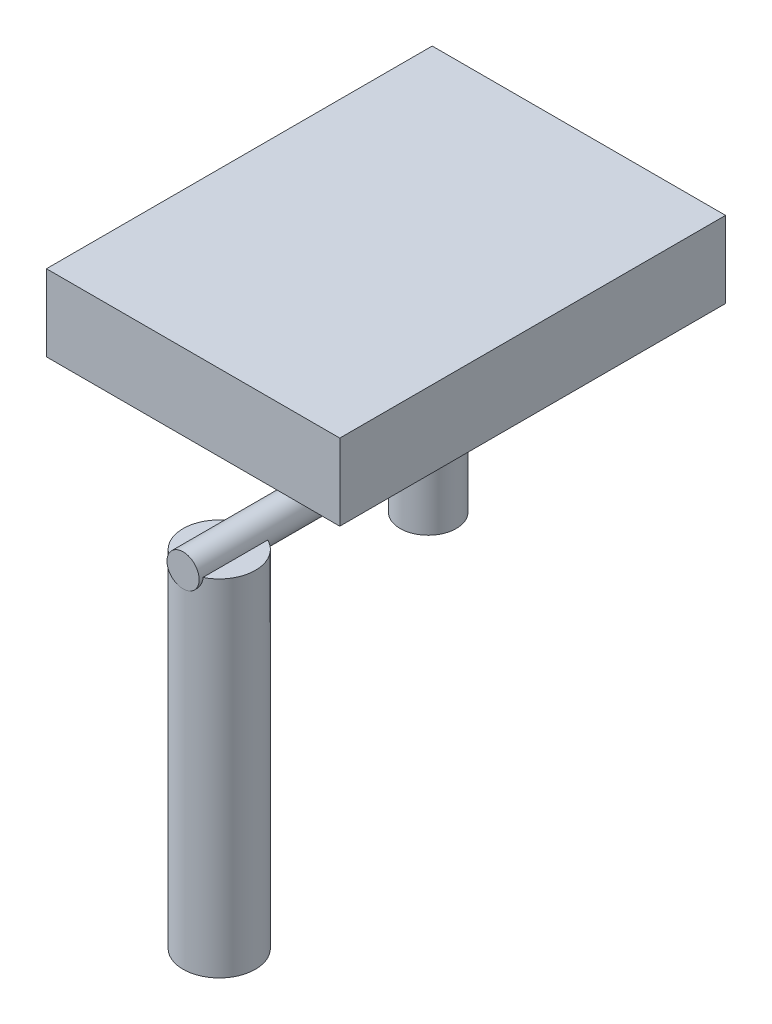
ISO-10303-21;
HEADER;
FILE_DESCRIPTION(('STEP AP214'),'2;1');
FILE_NAME('part.step','',(''),(''),'','','');
FILE_SCHEMA(('AUTOMOTIVE_DESIGN { 1 0 10303 214 1 1 1 1 }'));
ENDSEC;
DATA;
#1=APPLICATION_CONTEXT('core data for automotive mechanical design processes');
#2=APPLICATION_PROTOCOL_DEFINITION('international standard','automotive_design',2000,#1);
#3=PRODUCT_CONTEXT('',#1,'mechanical');
#4=PRODUCT('Part','Part','',(#3));
#5=PRODUCT_RELATED_PRODUCT_CATEGORY('part','',(#4));
#6=PRODUCT_DEFINITION_FORMATION('','',#4);
#7=PRODUCT_DEFINITION_CONTEXT('part definition',#1,'design');
#8=PRODUCT_DEFINITION('design','',#6,#7);
#9=PRODUCT_DEFINITION_SHAPE('','',#8);
#10=(LENGTH_UNIT() NAMED_UNIT(*) SI_UNIT(.MILLI.,.METRE.));
#11=(NAMED_UNIT(*) PLANE_ANGLE_UNIT() SI_UNIT($,.RADIAN.));
#12=(NAMED_UNIT(*) SI_UNIT($,.STERADIAN.) SOLID_ANGLE_UNIT());
#13=UNCERTAINTY_MEASURE_WITH_UNIT(LENGTH_MEASURE(1.E-05),#10,'distance_accuracy_value','');
#14=(GEOMETRIC_REPRESENTATION_CONTEXT(3) GLOBAL_UNCERTAINTY_ASSIGNED_CONTEXT((#13)) GLOBAL_UNIT_ASSIGNED_CONTEXT((#10,
#11,#12)) REPRESENTATION_CONTEXT('',''));
#15=CARTESIAN_POINT('',(0.,0.,0.));
#16=DIRECTION('',(0.,0.,1.));
#17=DIRECTION('',(1.,0.,0.));
#18=AXIS2_PLACEMENT_3D('',#15,#16,#17);
#19=CARTESIAN_POINT('',(90.8482356555996,-633.107228483542,435.));
#20=DIRECTION('',(0.,1.,0.));
#21=DIRECTION('',(0.,0.,1.));
#22=AXIS2_PLACEMENT_3D('',#19,#20,#21);
#23=CYLINDRICAL_SURFACE('',#22,45.);
#24=CARTESIAN_POINT('',(90.8482356555996,-633.107228483542,435.));
#25=DIRECTION('',(0.,-1.,0.));
#26=DIRECTION('',(0.,0.,-1.));
#27=AXIS2_PLACEMENT_3D('',#24,#25,#26);
#28=CIRCLE('',#27,45.);
#29=CARTESIAN_POINT('',(90.8482356555996,-633.107228483542,390.));
#30=VERTEX_POINT('',#29);
#31=EDGE_CURVE('E11',#30,#30,#28,.T.);
#32=ORIENTED_EDGE('',*,*,#31,.F.);
#33=EDGE_LOOP('',(#32));
#34=FACE_BOUND('',#33,.T.);
#35=CARTESIAN_POINT('',(90.8482356555996,-203.107228483542,435.));
#36=DIRECTION('',(0.,-1.,0.));
#37=DIRECTION('',(0.,0.,-1.));
#38=AXIS2_PLACEMENT_3D('',#35,#36,#37);
#39=CIRCLE('',#38,45.);
#40=CARTESIAN_POINT('',(90.8482356555996,-203.107228483542,390.));
#41=VERTEX_POINT('',#40);
#42=EDGE_CURVE('E46',#41,#41,#39,.T.);
#43=ORIENTED_EDGE('',*,*,#42,.T.);
#44=EDGE_LOOP('',(#43));
#45=FACE_BOUND('',#44,.T.);
#46=ADVANCED_FACE('F43',(#34,#45),#23,.T.);
#47=CARTESIAN_POINT('',(90.8482356555996,-633.107228483542,435.));
#48=DIRECTION('',(0.,-1.,0.));
#49=DIRECTION('',(0.,0.,-1.));
#50=AXIS2_PLACEMENT_3D('',#47,#48,#49);
#51=PLANE('',#50);
#52=ORIENTED_EDGE('',*,*,#31,.T.);
#53=EDGE_LOOP('',(#52));
#54=FACE_BOUND('',#53,.T.);
#55=ADVANCED_FACE('F58',(#54),#51,.T.);
#56=CARTESIAN_POINT('',(90.8482356555996,-203.107228483542,435.));
#57=DIRECTION('',(0.,-1.,0.));
#58=DIRECTION('',(0.,0.,-1.));
#59=AXIS2_PLACEMENT_3D('',#56,#57,#58);
#60=PLANE('',#59);
#61=ORIENTED_EDGE('',*,*,#42,.F.);
#62=EDGE_LOOP('',(#61));
#63=FACE_BOUND('',#62,.T.);
#64=ADVANCED_FACE('F56',(#63),#60,.F.);
#65=CLOSED_SHELL('',(#46,#55,#64));
#66=MANIFOLD_SOLID_BREP('B2',#65);
#67=CARTESIAN_POINT('',(-79.1517643444004,-113.107228483542,140.));
#68=DIRECTION('',(0.,0.,1.));
#69=DIRECTION('',(1.,0.,0.));
#70=AXIS2_PLACEMENT_3D('',#67,#68,#69);
#71=PLANE('',#70);
#72=DIRECTION('',(0.,1.,0.));
#73=VECTOR('',#72,1.);
#74=CARTESIAN_POINT('',(42.1142639315548,-108.107228483542,140.));
#75=LINE('',#74,#73);
#76=CARTESIAN_POINT('',(42.1142639315548,-108.107228483542,140.));
#77=VERTEX_POINT('',#76);
#78=CARTESIAN_POINT('',(42.1142639315548,-58.1072284835422,140.));
#79=VERTEX_POINT('',#78);
#80=EDGE_CURVE('E101',#77,#79,#75,.T.);
#81=ORIENTED_EDGE('',*,*,#80,.F.);
#82=DIRECTION('',(1.,0.,0.));
#83=VECTOR('',#82,1.);
#84=CARTESIAN_POINT('',(-79.1517643444004,-108.107228483542,140.));
#85=LINE('',#84,#83);
#86=CARTESIAN_POINT('',(125.8482356556,-108.107228483542,140.));
#87=VERTEX_POINT('',#86);
#88=EDGE_CURVE('E105',#77,#87,#85,.T.);
#89=ORIENTED_EDGE('',*,*,#88,.T.);
#90=DIRECTION('',(0.,1.,0.));
#91=VECTOR('',#90,1.);
#92=CARTESIAN_POINT('',(125.8482356556,-113.107228483542,140.));
#93=LINE('',#92,#91);
#94=CARTESIAN_POINT('',(125.8482356556,-113.107228483542,140.));
#95=VERTEX_POINT('',#94);
#96=EDGE_CURVE('E302',#95,#87,#93,.T.);
#97=ORIENTED_EDGE('',*,*,#96,.F.);
#98=DIRECTION('',(1.,0.,0.));
#99=VECTOR('',#98,1.);
#100=CARTESIAN_POINT('',(-79.1517643444004,-113.107228483542,140.));
#101=LINE('',#100,#99);
#102=CARTESIAN_POINT('',(90.8482356555996,-113.107228483542,140.));
#103=VERTEX_POINT('',#102);
#104=EDGE_CURVE('E320',#103,#95,#101,.T.);
#105=ORIENTED_EDGE('',*,*,#104,.F.);
#106=CARTESIAN_POINT('',(-79.1517643444004,-113.107228483542,140.));
#107=VERTEX_POINT('',#106);
#108=EDGE_CURVE('E321',#107,#103,#101,.T.);
#109=ORIENTED_EDGE('',*,*,#108,.F.);
#110=DIRECTION('',(0.,1.,0.));
#111=VECTOR('',#110,1.);
#112=CARTESIAN_POINT('',(-79.1517643444004,-113.107228483542,140.));
#113=LINE('',#112,#111);
#114=CARTESIAN_POINT('',(-79.1517643444004,-58.1072284835422,140.));
#115=VERTEX_POINT('',#114);
#116=EDGE_CURVE('E310',#107,#115,#113,.T.);
#117=ORIENTED_EDGE('',*,*,#116,.T.);
#118=DIRECTION('',(1.,0.,0.));
#119=VECTOR('',#118,1.);
#120=CARTESIAN_POINT('',(-79.1517643444004,-58.1072284835422,140.));
#121=LINE('',#120,#119);
#122=EDGE_CURVE('E180',#115,#79,#121,.T.);
#123=ORIENTED_EDGE('',*,*,#122,.T.);
#124=EDGE_LOOP('',(#81,#89,#97,#105,#109,#117,#123));
#125=FACE_BOUND('',#124,.T.);
#126=ADVANCED_FACE('F86',(#125),#71,.F.);
#127=CARTESIAN_POINT('',(-79.1517643444004,-113.107228483542,210.000000000009));
#128=DIRECTION('',(0.,0.,-1.));
#129=DIRECTION('',(-1.,0.,0.));
#130=AXIS2_PLACEMENT_3D('',#127,#128,#129);
#131=PLANE('',#130);
#132=DIRECTION('',(0.,1.,0.));
#133=VECTOR('',#132,1.);
#134=CARTESIAN_POINT('',(42.1142639315616,-108.107228483542,210.000000000009));
#135=LINE('',#134,#133);
#136=CARTESIAN_POINT('',(42.1142639315616,-58.1072284835422,210.000000000009));
#137=VERTEX_POINT('',#136);
#138=CARTESIAN_POINT('',(42.1142639315616,-108.107228483542,210.000000000009));
#139=VERTEX_POINT('',#138);
#140=EDGE_CURVE('E183',#137,#139,#135,.F.);
#141=ORIENTED_EDGE('',*,*,#140,.F.);
#142=DIRECTION('',(-1.,0.,0.));
#143=VECTOR('',#142,1.);
#144=CARTESIAN_POINT('',(-79.1517643444004,-58.1072284835422,210.000000000009));
#145=LINE('',#144,#143);
#146=CARTESIAN_POINT('',(-79.1517643444004,-58.1072284835422,210.000000000009));
#147=VERTEX_POINT('',#146);
#148=EDGE_CURVE('E170',#137,#147,#145,.T.);
#149=ORIENTED_EDGE('',*,*,#148,.T.);
#150=DIRECTION('',(0.,1.,0.));
#151=VECTOR('',#150,1.);
#152=CARTESIAN_POINT('',(-79.1517643444004,-113.107228483542,210.000000000009));
#153=LINE('',#152,#151);
#154=CARTESIAN_POINT('',(-79.1517643444004,-113.107228483542,210.000000000009));
#155=VERTEX_POINT('',#154);
#156=EDGE_CURVE('E329',#155,#147,#153,.T.);
#157=ORIENTED_EDGE('',*,*,#156,.F.);
#158=DIRECTION('',(-1.,0.,0.));
#159=VECTOR('',#158,1.);
#160=CARTESIAN_POINT('',(-79.1517643444004,-113.107228483542,210.000000000009));
#161=LINE('',#160,#159);
#162=CARTESIAN_POINT('',(90.8482356555996,-113.107228483542,210.000000000009));
#163=VERTEX_POINT('',#162);
#164=EDGE_CURVE('E325',#163,#155,#161,.T.);
#165=ORIENTED_EDGE('',*,*,#164,.F.);
#166=CARTESIAN_POINT('',(125.8482356556,-113.107228483542,210.000000000009));
#167=VERTEX_POINT('',#166);
#168=EDGE_CURVE('E326',#167,#163,#161,.T.);
#169=ORIENTED_EDGE('',*,*,#168,.F.);
#170=DIRECTION('',(0.,1.,0.));
#171=VECTOR('',#170,1.);
#172=CARTESIAN_POINT('',(125.8482356556,-113.107228483542,210.000000000009));
#173=LINE('',#172,#171);
#174=CARTESIAN_POINT('',(125.8482356556,-108.107228483542,210.000000000009));
#175=VERTEX_POINT('',#174);
#176=EDGE_CURVE('E311',#167,#175,#173,.T.);
#177=ORIENTED_EDGE('',*,*,#176,.T.);
#178=DIRECTION('',(-1.,0.,0.));
#179=VECTOR('',#178,1.);
#180=CARTESIAN_POINT('',(-79.1517643444004,-108.107228483542,210.000000000009));
#181=LINE('',#180,#179);
#182=EDGE_CURVE('E41',#175,#139,#181,.T.);
#183=ORIENTED_EDGE('',*,*,#182,.T.);
#184=EDGE_LOOP('',(#141,#149,#157,#165,#169,#177,#183));
#185=FACE_BOUND('',#184,.T.);
#186=ADVANCED_FACE('F184',(#185),#131,.F.);
#187=CARTESIAN_POINT('',(90.8482356555996,-293.107228483542,175.));
#188=DIRECTION('',(0.,1.,0.));
#189=DIRECTION('',(0.,0.,1.));
#190=AXIS2_PLACEMENT_3D('',#187,#188,#189);
#191=CYLINDRICAL_SURFACE('',#190,35.);
#192=CARTESIAN_POINT('',(90.8482356555996,-113.107228483542,175.));
#193=DIRECTION('',(0.,-1.,0.));
#194=DIRECTION('',(0.,0.,-1.));
#195=AXIS2_PLACEMENT_3D('',#192,#193,#194);
#196=CIRCLE('',#195,35.);
#197=EDGE_CURVE('E197',#163,#103,#196,.T.);
#198=ORIENTED_EDGE('',*,*,#197,.T.);
#199=CARTESIAN_POINT('',(125.8482356556,-113.107228483542,175.));
#200=VERTEX_POINT('',#199);
#201=EDGE_CURVE('E193',#103,#200,#196,.T.);
#202=ORIENTED_EDGE('',*,*,#201,.T.);
#203=EDGE_CURVE('E195',#200,#163,#196,.T.);
#204=ORIENTED_EDGE('',*,*,#203,.T.);
#205=EDGE_LOOP('',(#198,#202,#204));
#206=FACE_BOUND('',#205,.T.);
#207=CARTESIAN_POINT('',(110.8482356556,-203.107228483542,203.722813232815));
#208=CARTESIAN_POINT('',(110.848234049777,-202.598398351658,203.722815514205));
#209=CARTESIAN_POINT('',(110.828788003848,-202.089545389906,203.736384514361));
#210=CARTESIAN_POINT('',(110.751330782595,-201.076196425035,203.790084734188));
#211=CARTESIAN_POINT('',(110.693316962123,-200.571700723161,203.830217775739));
#212=CARTESIAN_POINT('',(110.539593579744,-199.570691255811,203.935429220474));
#213=CARTESIAN_POINT('',(110.443849883236,-199.074185143149,204.000530210983));
#214=CARTESIAN_POINT('',(110.216057786976,-198.093138183986,204.153150903094));
#215=CARTESIAN_POINT('',(110.084008834769,-197.608597519684,204.240670945843));
#216=CARTESIAN_POINT('',(109.786269829341,-196.65761927396,204.434370036913));
#217=CARTESIAN_POINT('',(109.620815358958,-196.191080763867,204.540417755222));
#218=CARTESIAN_POINT('',(109.257309507684,-195.274659684021,204.768305371151));
#219=CARTESIAN_POINT('',(109.059243306577,-194.824784801347,204.890152443323));
#220=CARTESIAN_POINT('',(108.632152049241,-193.943599741511,205.146215226748));
#221=CARTESIAN_POINT('',(108.403122848491,-193.512292059851,205.280432593047));
#222=CARTESIAN_POINT('',(107.915693040628,-192.669859599668,205.557822279532));
#223=CARTESIAN_POINT('',(107.657301728476,-192.258728492673,205.70099175939));
#224=CARTESIAN_POINT('',(107.08241614573,-191.413619082447,206.009177630936));
#225=CARTESIAN_POINT('',(106.762657064234,-190.982103372334,206.17486467541));
#226=CARTESIAN_POINT('',(106.090122655126,-190.146811017821,206.509140033748));
#227=CARTESIAN_POINT('',(105.737345553885,-189.743035865582,206.677728503071));
#228=CARTESIAN_POINT('',(105.000049401783,-188.964608237173,207.01390951882));
#229=CARTESIAN_POINT('',(104.615511113294,-188.589973682044,207.18150139476));
#230=CARTESIAN_POINT('',(103.816360695663,-187.871863900761,207.511762243951));
#231=CARTESIAN_POINT('',(103.401747239546,-187.528390050984,207.674430999535));
#232=CARTESIAN_POINT('',(102.5032288362,-186.84347098525,208.006237168639));
#233=CARTESIAN_POINT('',(102.016483763297,-186.505323148515,208.17451927292));
#234=CARTESIAN_POINT('',(101.011246590569,-185.871619316883,208.496144347982));
#235=CARTESIAN_POINT('',(100.492751952528,-185.576066733612,208.649486121815));
#236=CARTESIAN_POINT('',(99.4274099397858,-185.030847467856,208.936733640734));
#237=CARTESIAN_POINT('',(98.8805806930701,-184.781151900466,209.070651609439));
#238=CARTESIAN_POINT('',(97.7621257309969,-184.330608992163,209.315092928472));
#239=CARTESIAN_POINT('',(97.1905036473392,-184.129754525202,209.425619691335));
#240=CARTESIAN_POINT('',(96.0786046359247,-183.795318180975,209.611158728171));
#241=CARTESIAN_POINT('',(95.5400225109447,-183.65735957047,209.68844647606));
#242=CARTESIAN_POINT('',(94.4503701283232,-183.42640779097,209.818465906929));
#243=CARTESIAN_POINT('',(93.8993005448684,-183.333412200489,209.871198912301));
#244=CARTESIAN_POINT('',(92.7898295137136,-183.193850877783,209.950526637622));
#245=CARTESIAN_POINT('',(92.2314334231933,-183.147252948293,209.977139483252));
#246=CARTESIAN_POINT('',(91.1120861667447,-183.101128004483,210.003480919724));
#247=CARTESIAN_POINT('',(90.5511352306212,-183.101596837039,210.003211882596));
#248=CARTESIAN_POINT('',(89.4952002850984,-183.146861766144,209.97736402944));
#249=CARTESIAN_POINT('',(88.999921376119,-183.18664539521,209.954647226381));
#250=CARTESIAN_POINT('',(88.0150879230803,-183.302707249315,209.888633863787));
#251=CARTESIAN_POINT('',(87.5255328512608,-183.3789820821,209.845339217188));
#252=CARTESIAN_POINT('',(86.5554751224256,-183.567106976639,209.73917571407));
#253=CARTESIAN_POINT('',(86.0749727664999,-183.678958219446,209.676306207712));
#254=CARTESIAN_POINT('',(85.1260620329673,-183.936977889577,209.532405761456));
#255=CARTESIAN_POINT('',(84.6576541394093,-184.083147688054,209.451374095919));
#256=CARTESIAN_POINT('',(83.7315694472168,-184.409734858269,209.272109339074));
#257=CARTESIAN_POINT('',(83.2740230792304,-184.590441827515,209.173731380281));
#258=CARTESIAN_POINT('',(82.3763155579042,-184.983578103336,208.962320943038));
#259=CARTESIAN_POINT('',(81.9361542906454,-185.196007202003,208.849288560635));
#260=CARTESIAN_POINT('',(81.0750902201167,-185.650918052459,208.610790742156));
#261=CARTESIAN_POINT('',(80.6541905311757,-185.893404640785,208.485323305813));
#262=CARTESIAN_POINT('',(79.8333142202949,-186.406752429689,208.22434419058));
#263=CARTESIAN_POINT('',(79.433339646831,-186.677616400523,208.088831531433));
#264=CARTESIAN_POINT('',(78.6117247540293,-187.278292635809,207.7944981052));
#265=CARTESIAN_POINT('',(78.1927464053389,-187.611307298464,207.634774194621));
#266=CARTESIAN_POINT('',(77.384042119395,-188.308559868767,207.309526333914));
#267=CARTESIAN_POINT('',(76.9943181230586,-188.672799844669,207.144002000015));
#268=CARTESIAN_POINT('',(76.2451731898401,-189.431155708615,206.810671711783));
#269=CARTESIAN_POINT('',(75.8857875573904,-189.825305416875,206.642863356118));
#270=CARTESIAN_POINT('',(75.1992782207269,-190.641494350158,206.30903773744));
#271=CARTESIAN_POINT('',(74.8721558449015,-191.063534722341,206.143020548427));
#272=CARTESIAN_POINT('',(74.2207515605086,-191.977436063298,205.800573470758));
#273=CARTESIAN_POINT('',(73.9000112671292,-192.472061591879,205.624757927389));
#274=CARTESIAN_POINT('',(73.3017430992036,-193.491111393903,205.285951335655));
#275=CARTESIAN_POINT('',(73.0242212155579,-194.015539784866,205.122962066805));
#276=CARTESIAN_POINT('',(72.5154726858053,-195.090806586504,204.816069018923));
#277=CARTESIAN_POINT('',(72.2841787822898,-195.64160516221,204.672137616977));
#278=CARTESIAN_POINT('',(71.8703677384913,-196.766915283463,204.409195162511));
#279=CARTESIAN_POINT('',(71.6878335447786,-197.34141845709,204.290175400449));
#280=CARTESIAN_POINT('',(71.410327644969,-198.375917481518,204.106505513919));
#281=CARTESIAN_POINT('',(71.3048768554109,-198.83202479426,204.035646243309));
#282=CARTESIAN_POINT('',(71.1259126253304,-199.753131390831,203.914385942866));
#283=CARTESIAN_POINT('',(71.0523942804107,-200.218129297722,203.86398177148));
#284=CARTESIAN_POINT('',(70.9383045343374,-201.153639303637,203.785403571531));
#285=CARTESIAN_POINT('',(70.897706285528,-201.624146591183,203.757211428702));
#286=CARTESIAN_POINT('',(70.8499348863405,-202.567695608278,203.724011336462));
#287=CARTESIAN_POINT('',(70.8427625877072,-203.040737402103,203.719003977834));
#288=CARTESIAN_POINT('',(70.8619584953767,-203.986070332696,203.732366011801));
#289=CARTESIAN_POINT('',(70.8883455774342,-204.458360897281,203.750748560246));
#290=CARTESIAN_POINT('',(70.9743052216287,-205.398450172198,203.810234261962));
#291=CARTESIAN_POINT('',(71.0338779070677,-205.866248865834,203.851337499651));
#292=CARTESIAN_POINT('',(71.1854344147368,-206.794440973273,203.954837932465));
#293=CARTESIAN_POINT('',(71.2774380397249,-207.254829682436,204.017248137171));
#294=CARTESIAN_POINT('',(71.4927124992625,-208.165144713962,204.161283566115));
#295=CARTESIAN_POINT('',(71.6159843019368,-208.615070711909,204.242909385302));
#296=CARTESIAN_POINT('',(71.8941622966148,-209.507561496774,204.423985949482));
#297=CARTESIAN_POINT('',(72.0494357733208,-209.949969706596,204.523641839541));
#298=CARTESIAN_POINT('',(72.3893119905185,-210.819968569256,204.737323694833));
#299=CARTESIAN_POINT('',(72.573926712903,-211.247553081367,204.851355526726));
#300=CARTESIAN_POINT('',(72.9710727070687,-212.086222800304,205.090875663778));
#301=CARTESIAN_POINT('',(73.183605298493,-212.497307225991,205.216364510411));
#302=CARTESIAN_POINT('',(73.6353181310592,-213.301752207615,205.475946812906));
#303=CARTESIAN_POINT('',(73.8745012645467,-213.695110833276,205.610041202044));
#304=CARTESIAN_POINT('',(74.4202731588131,-214.526901088886,205.906858164307));
#305=CARTESIAN_POINT('',(74.7314566830387,-214.961949629718,206.070633108195));
#306=CARTESIAN_POINT('',(75.386862286075,-215.804906296893,206.401923223873));
#307=CARTESIAN_POINT('',(75.7310872539283,-216.212812044663,206.569438721741));
#308=CARTESIAN_POINT('',(76.4513518775169,-217.000198672975,206.904350392763));
#309=CARTESIAN_POINT('',(76.8274158549203,-217.379657398101,207.071746374374));
#310=CARTESIAN_POINT('',(77.6096704366687,-218.108096758641,207.402480479123));
#311=CARTESIAN_POINT('',(78.0158621809359,-218.457076239746,207.565818448409));
#312=CARTESIAN_POINT('',(78.8989613729431,-219.155992239822,207.900752751867));
#313=CARTESIAN_POINT('',(79.3788776377055,-219.502529213928,208.071539608737));
#314=CARTESIAN_POINT('',(80.3710009609607,-220.153624305634,208.399108562526));
#315=CARTESIAN_POINT('',(80.8832107412767,-220.458178877881,208.555889476273));
#316=CARTESIAN_POINT('',(81.9366818416397,-221.022051522092,208.850896352084));
#317=CARTESIAN_POINT('',(82.4779253860733,-221.281396868733,208.989133489905));
#318=CARTESIAN_POINT('',(83.5860656226443,-221.751880824044,209.243011131526));
#319=CARTESIAN_POINT('',(84.1529587558529,-221.963026096138,209.358654758447));
#320=CARTESIAN_POINT('',(85.2608568752178,-222.318986625928,209.555339735766));
#321=CARTESIAN_POINT('',(85.8002131304708,-222.467802017563,209.638431417436));
#322=CARTESIAN_POINT('',(86.8925962968459,-222.72015970197,209.780111297691));
#323=CARTESIAN_POINT('',(87.4456225581268,-222.823704142465,209.838700658695));
#324=CARTESIAN_POINT('',(88.5601575121226,-222.98388396327,209.929601838674));
#325=CARTESIAN_POINT('',(89.1216596448963,-223.040553899555,209.961933014915));
#326=CARTESIAN_POINT('',(90.2483299300508,-223.10618928743,209.999395465561));
#327=CARTESIAN_POINT('',(90.8134977201263,-223.115159383738,210.004529388269));
#328=CARTESIAN_POINT('',(91.8762921654838,-223.087015899718,209.988453100016));
#329=CARTESIAN_POINT('',(92.3741136704523,-223.055151444469,209.970243514244));
#330=CARTESIAN_POINT('',(93.3647570153866,-222.954518894388,209.912937633348));
#331=CARTESIAN_POINT('',(93.857579326577,-222.885754311328,209.873843325817));
#332=CARTESIAN_POINT('',(94.8347958315791,-222.71216783332,209.775688829309));
#333=CARTESIAN_POINT('',(95.3191898695887,-222.60734527256,209.716628271656));
#334=CARTESIAN_POINT('',(96.2764081208798,-222.362850508144,209.579888891838));
#335=CARTESIAN_POINT('',(96.7492319105391,-222.223177030578,209.502209389097));
#336=CARTESIAN_POINT('',(97.6812293827322,-221.910213199232,209.329799878135));
#337=CARTESIAN_POINT('',(98.140380843417,-221.736871232456,209.235043708088));
#338=CARTESIAN_POINT('',(99.0418721332395,-221.358347199238,209.030544740334));
#339=CARTESIAN_POINT('',(99.484212155637,-221.153165498956,208.920802114974));
#340=CARTESIAN_POINT('',(100.350145592222,-220.712617889988,208.688495143091));
#341=CARTESIAN_POINT('',(100.773736350362,-220.477247723052,208.565928988188));
#342=CARTESIAN_POINT('',(101.600470322746,-219.977992826069,208.310309395218));
#343=CARTESIAN_POINT('',(102.003611519225,-219.714105290213,208.17725492556));
#344=CARTESIAN_POINT('',(102.831140914082,-219.128908672422,207.888031150127));
#345=CARTESIAN_POINT('',(103.252996507079,-218.804476186125,207.730928421295));
#346=CARTESIAN_POINT('',(104.068141407336,-218.124414871151,207.410275601045));
#347=CARTESIAN_POINT('',(104.46142888759,-217.768784050464,207.246725098306));
#348=CARTESIAN_POINT('',(105.218392785846,-217.027697037486,206.91659855863));
#349=CARTESIAN_POINT('',(105.582035478156,-216.642207822184,206.750019332326));
#350=CARTESIAN_POINT('',(106.277795164768,-215.843369292843,206.417786976181));
#351=CARTESIAN_POINT('',(106.609910814929,-215.430018792234,206.252133886108));
#352=CARTESIAN_POINT('',(107.274203024754,-214.532253969755,205.908601702861));
#353=CARTESIAN_POINT('',(107.602740815046,-214.044931448066,205.731259894845));
#354=CARTESIAN_POINT('',(108.217282598845,-213.040155406365,205.388157575602));
#355=CARTESIAN_POINT('',(108.503280529527,-212.522697606036,205.222398716971));
#356=CARTESIAN_POINT('',(109.02975926178,-211.460843756763,204.90862788039));
#357=CARTESIAN_POINT('',(109.270301003541,-210.916485025942,204.760592241105));
#358=CARTESIAN_POINT('',(109.703417830882,-209.803378425535,204.488093964178));
#359=CARTESIAN_POINT('',(109.896009188706,-209.234638906725,204.363623333056));
#360=CARTESIAN_POINT('',(110.191849143888,-208.210158678693,204.169303698729));
#361=CARTESIAN_POINT('',(110.30545851856,-207.758519604341,204.093476306982));
#362=CARTESIAN_POINT('',(110.501273443654,-206.845663928181,203.961562335676));
#363=CARTESIAN_POINT('',(110.583484135539,-206.384448907464,203.90547252425));
#364=CARTESIAN_POINT('',(110.715413174269,-205.455650706052,203.814955878354));
#365=CARTESIAN_POINT('',(110.765157525935,-204.988072929023,203.780511707029));
#366=CARTESIAN_POINT('',(110.831570773088,-204.049412962396,203.734438456863));
#367=CARTESIAN_POINT('',(110.848237142355,-203.578330507899,203.722811120583));
#368=CARTESIAN_POINT('',(110.8482356556,-203.107228483542,203.722813232815));
#369=B_SPLINE_CURVE_WITH_KNOTS('',3,(#207,#208,#209,#210,#211,#212,#213,#214,#215,#216,#217,
#218,#219,#220,#221,#222,#223,#224,#225,#226,#227,#228,#229,#230,#231,#232,#233,#234,#235,#236,
#237,#238,#239,#240,#241,#242,#243,#244,#245,#246,#247,#248,#249,#250,#251,#252,#253,#254,#255,
#256,#257,#258,#259,#260,#261,#262,#263,#264,#265,#266,#267,#268,#269,#270,#271,#272,#273,#274,
#275,#276,#277,#278,#279,#280,#281,#282,#283,#284,#285,#286,#287,#288,#289,#290,#291,#292,#293,
#294,#295,#296,#297,#298,#299,#300,#301,#302,#303,#304,#305,#306,#307,#308,#309,#310,#311,#312,
#313,#314,#315,#316,#317,#318,#319,#320,#321,#322,#323,#324,#325,#326,#327,#328,#329,#330,#331,
#332,#333,#334,#335,#336,#337,#338,#339,#340,#341,#342,#343,#344,#345,#346,#347,#348,#349,#350,
#351,#352,#353,#354,#355,#356,#357,#358,#359,#360,#361,#362,#363,#364,#365,#366,#367,#368),
.UNSPECIFIED.,.T.,.F.,(4,2,2,2,2,2,2,2,2,2,2,2,2,2,2,2,2,2,2,2,2,2,2,2,2,2,2,2,2,2,2,2,2,2,2,2,
2,2,2,2,2,2,2,2,2,2,2,2,2,2,2,2,2,2,2,2,2,2,2,2,2,2,2,2,2,2,2,2,2,2,2,2,2,2,2,2,2,2,2,2,4),(0.,
1.5259853152665,3.05207530014782,4.57954913557131,6.10704621569329,7.62412539438267,
9.14189591361753,10.6598697940084,12.1773644716147,13.8618082157449,15.5463424951131,
17.2319046796535,18.9175412797968,20.763433745281,22.6094739736472,24.4543473801369,
26.2989514529114,27.9805258814885,29.6620097386478,31.3423259293355,33.0224938507251,
34.5128973255094,36.0031622780199,37.4934767089975,38.9838506936984,40.487318244728,
41.9907759423743,43.494475875479,44.9983227397347,46.6721682769753,48.3461247696427,
50.0220031200316,51.6979504432647,53.541156930736,55.3846186949838,57.2253785511256,
59.0654937666052,60.4844307757374,61.9031497779473,63.3207105910529,64.7383075255984,
66.1567021521526,67.575102048828,68.9943695437162,70.4136809873051,71.8502928064814,
73.2874927999799,74.7247607525993,76.1621848420925,77.83865466153,79.5152712001102,
81.1931802581145,82.8711528343578,84.7170555542803,86.5631140625886,88.4080549619885,
90.2527406527183,91.947274071956,93.6417270912377,95.3349298403223,97.0279677126705,
98.5236850427661,100.01926005123,101.514862677048,103.010519979766,104.508488448263,
106.006439691293,107.50460246153,109.002912769624,110.665854179433,112.328901845208,
113.993815830961,115.658800767707,117.498216584017,119.337894305172,121.175087914721,
123.011657209388,124.425753286657,125.839617709464,127.252348263775,128.665186706537),.UNSPECIFIED.);
#370=CARTESIAN_POINT('',(110.8482356556,-203.107228483542,203.722813232815));
#371=VERTEX_POINT('',#370);
#372=EDGE_CURVE('E232',#371,#371,#369,.T.);
#373=ORIENTED_EDGE('',*,*,#372,.F.);
#374=EDGE_LOOP('',(#373));
#375=FACE_BOUND('',#374,.T.);
#376=CARTESIAN_POINT('',(90.8482356555996,-293.107228483542,175.));
#377=DIRECTION('',(0.,-1.,0.));
#378=DIRECTION('',(0.,0.,-1.));
#379=AXIS2_PLACEMENT_3D('',#376,#377,#378);
#380=CIRCLE('',#379,35.);
#381=CARTESIAN_POINT('',(90.8482356555996,-293.107228483542,140.));
#382=VERTEX_POINT('',#381);
#383=EDGE_CURVE('E222',#382,#382,#380,.T.);
#384=ORIENTED_EDGE('',*,*,#383,.F.);
#385=EDGE_LOOP('',(#384));
#386=FACE_BOUND('',#385,.T.);
#387=ADVANCED_FACE('F250',(#206,#375,#386),#191,.T.);
#388=CARTESIAN_POINT('',(90.8482356555996,-293.107228483542,175.));
#389=DIRECTION('',(0.,-1.,0.));
#390=DIRECTION('',(0.,0.,-1.));
#391=AXIS2_PLACEMENT_3D('',#388,#389,#390);
#392=PLANE('',#391);
#393=ORIENTED_EDGE('',*,*,#383,.T.);
#394=EDGE_LOOP('',(#393));
#395=FACE_BOUND('',#394,.T.);
#396=ADVANCED_FACE('F246',(#395),#392,.T.);
#397=CARTESIAN_POINT('',(90.8482356555996,-203.107228483542,480.));
#398=DIRECTION('',(0.,0.,1.));
#399=DIRECTION('',(1.,0.,0.));
#400=AXIS2_PLACEMENT_3D('',#397,#398,#399);
#401=PLANE('',#400);
#402=CARTESIAN_POINT('',(90.8482356555996,-203.107228483542,480.));
#403=DIRECTION('',(0.,0.,1.));
#404=DIRECTION('',(1.,0.,0.));
#405=AXIS2_PLACEMENT_3D('',#402,#403,#404);
#406=CIRCLE('',#405,20.);
#407=CARTESIAN_POINT('',(110.8482356556,-203.107228483542,480.));
#408=VERTEX_POINT('',#407);
#409=EDGE_CURVE('E239',#408,#408,#406,.T.);
#410=ORIENTED_EDGE('',*,*,#409,.T.);
#411=EDGE_LOOP('',(#410));
#412=FACE_BOUND('',#411,.T.);
#413=ADVANCED_FACE('F249',(#412),#401,.T.);
#414=CARTESIAN_POINT('',(90.8482356555996,-203.107228483542,-500000.));
#415=DIRECTION('',(0.,0.,1.));
#416=DIRECTION('',(1.,0.,0.));
#417=AXIS2_PLACEMENT_3D('',#414,#415,#416);
#418=CYLINDRICAL_SURFACE('',#417,20.);
#419=ORIENTED_EDGE('',*,*,#409,.F.);
#420=EDGE_LOOP('',(#419));
#421=FACE_BOUND('',#420,.T.);
#422=ORIENTED_EDGE('',*,*,#372,.T.);
#423=EDGE_LOOP('',(#422));
#424=FACE_BOUND('',#423,.T.);
#425=ADVANCED_FACE('F241',(#421,#424),#418,.T.);
#426=CARTESIAN_POINT('',(125.8482356556,-113.107228483542,210.000000000009));
#427=DIRECTION('',(-1.,0.,0.));
#428=DIRECTION('',(0.,0.,1.));
#429=AXIS2_PLACEMENT_3D('',#426,#427,#428);
#430=PLANE('',#429);
#431=ORIENTED_EDGE('',*,*,#96,.T.);
#432=DIRECTION('',(0.,0.,1.));
#433=VECTOR('',#432,1.);
#434=CARTESIAN_POINT('',(125.8482356556,-108.107228483542,210.000000000009));
#435=LINE('',#434,#433);
#436=EDGE_CURVE('E305',#87,#175,#435,.T.);
#437=ORIENTED_EDGE('',*,*,#436,.T.);
#438=ORIENTED_EDGE('',*,*,#176,.F.);
#439=DIRECTION('',(0.,0.,1.));
#440=VECTOR('',#439,1.);
#441=CARTESIAN_POINT('',(125.8482356556,-113.107228483542,210.000000000009));
#442=LINE('',#441,#440);
#443=EDGE_CURVE('E323',#200,#167,#442,.T.);
#444=ORIENTED_EDGE('',*,*,#443,.F.);
#445=EDGE_CURVE('E308',#95,#200,#442,.T.);
#446=ORIENTED_EDGE('',*,*,#445,.F.);
#447=EDGE_LOOP('',(#431,#437,#438,#444,#446));
#448=FACE_BOUND('',#447,.T.);
#449=ADVANCED_FACE('F284',(#448),#430,.F.);
#450=CARTESIAN_POINT('',(0.,-113.107228483542,0.));
#451=DIRECTION('',(0.,-1.,0.));
#452=DIRECTION('',(0.,0.,-1.));
#453=AXIS2_PLACEMENT_3D('',#450,#451,#452);
#454=PLANE('',#453);
#455=ORIENTED_EDGE('',*,*,#201,.F.);
#456=ORIENTED_EDGE('',*,*,#104,.T.);
#457=ORIENTED_EDGE('',*,*,#445,.T.);
#458=EDGE_LOOP('',(#455,#456,#457));
#459=FACE_BOUND('',#458,.T.);
#460=ADVANCED_FACE('F293',(#459),#454,.T.);
#461=ORIENTED_EDGE('',*,*,#203,.F.);
#462=ORIENTED_EDGE('',*,*,#443,.T.);
#463=ORIENTED_EDGE('',*,*,#168,.T.);
#464=EDGE_LOOP('',(#461,#462,#463));
#465=FACE_BOUND('',#464,.T.);
#466=ADVANCED_FACE('F298',(#465),#454,.T.);
#467=ORIENTED_EDGE('',*,*,#197,.F.);
#468=ORIENTED_EDGE('',*,*,#164,.T.);
#469=DIRECTION('',(0.,0.,-1.));
#470=VECTOR('',#469,1.);
#471=CARTESIAN_POINT('',(-79.1517643444004,-113.107228483542,210.000000000009));
#472=LINE('',#471,#470);
#473=EDGE_CURVE('E179',#155,#107,#472,.T.);
#474=ORIENTED_EDGE('',*,*,#473,.T.);
#475=ORIENTED_EDGE('',*,*,#108,.T.);
#476=EDGE_LOOP('',(#467,#468,#474,#475));
#477=FACE_BOUND('',#476,.T.);
#478=ADVANCED_FACE('F267',(#477),#454,.T.);
#479=CARTESIAN_POINT('',(-79.1517643444004,36.8927715164578,480.));
#480=DIRECTION('',(0.,-1.,0.));
#481=DIRECTION('',(0.,0.,-1.));
#482=AXIS2_PLACEMENT_3D('',#479,#480,#481);
#483=PLANE('',#482);
#484=DIRECTION('',(-1.,0.,0.));
#485=VECTOR('',#484,1.);
#486=CARTESIAN_POINT('',(-79.1517643444004,36.8927715164578,0.));
#487=LINE('',#486,#485);
#488=CARTESIAN_POINT('',(285.8482356556,36.8927715164578,0.));
#489=VERTEX_POINT('',#488);
#490=CARTESIAN_POINT('',(-79.1517643444004,36.8927715164578,0.));
#491=VERTEX_POINT('',#490);
#492=EDGE_CURVE('E212',#489,#491,#487,.T.);
#493=ORIENTED_EDGE('',*,*,#492,.T.);
#494=DIRECTION('',(0.,0.,-1.));
#495=VECTOR('',#494,1.);
#496=CARTESIAN_POINT('',(-79.1517643444004,36.8927715164578,480.));
#497=LINE('',#496,#495);
#498=CARTESIAN_POINT('',(-79.1517643444004,36.8927715164578,480.));
#499=VERTEX_POINT('',#498);
#500=EDGE_CURVE('E208',#499,#491,#497,.T.);
#501=ORIENTED_EDGE('',*,*,#500,.F.);
#502=DIRECTION('',(-1.,0.,0.));
#503=VECTOR('',#502,1.);
#504=CARTESIAN_POINT('',(-79.1517643444004,36.8927715164578,480.));
#505=LINE('',#504,#503);
#506=CARTESIAN_POINT('',(285.8482356556,36.8927715164578,480.));
#507=VERTEX_POINT('',#506);
#508=EDGE_CURVE('E211',#507,#499,#505,.T.);
#509=ORIENTED_EDGE('',*,*,#508,.F.);
#510=DIRECTION('',(0.,0.,-1.));
#511=VECTOR('',#510,1.);
#512=CARTESIAN_POINT('',(285.8482356556,36.8927715164578,480.));
#513=LINE('',#512,#511);
#514=EDGE_CURVE('E205',#507,#489,#513,.T.);
#515=ORIENTED_EDGE('',*,*,#514,.T.);
#516=EDGE_LOOP('',(#493,#501,#509,#515));
#517=FACE_BOUND('',#516,.T.);
#518=ADVANCED_FACE('F259',(#517),#483,.F.);
#519=CARTESIAN_POINT('',(0.,0.,480.));
#520=DIRECTION('',(0.,0.,1.));
#521=DIRECTION('',(1.,0.,0.));
#522=AXIS2_PLACEMENT_3D('',#519,#520,#521);
#523=PLANE('',#522);
#524=DIRECTION('',(0.,-1.,0.));
#525=VECTOR('',#524,1.);
#526=CARTESIAN_POINT('',(-79.1517643444004,36.8927715164578,480.));
#527=LINE('',#526,#525);
#528=CARTESIAN_POINT('',(-79.1517643444004,-58.1072284835422,480.));
#529=VERTEX_POINT('',#528);
#530=EDGE_CURVE('E214',#499,#529,#527,.T.);
#531=ORIENTED_EDGE('',*,*,#530,.T.);
#532=DIRECTION('',(1.,0.,0.));
#533=VECTOR('',#532,1.);
#534=CARTESIAN_POINT('',(-79.1517643444004,-58.1072284835422,480.));
#535=LINE('',#534,#533);
#536=CARTESIAN_POINT('',(285.8482356556,-58.1072284835422,480.));
#537=VERTEX_POINT('',#536);
#538=EDGE_CURVE('E226',#529,#537,#535,.T.);
#539=ORIENTED_EDGE('',*,*,#538,.T.);
#540=DIRECTION('',(0.,1.,0.));
#541=VECTOR('',#540,1.);
#542=CARTESIAN_POINT('',(285.8482356556,36.8927715164578,480.));
#543=LINE('',#542,#541);
#544=EDGE_CURVE('E224',#537,#507,#543,.T.);
#545=ORIENTED_EDGE('',*,*,#544,.T.);
#546=ORIENTED_EDGE('',*,*,#508,.T.);
#547=EDGE_LOOP('',(#531,#539,#545,#546));
#548=FACE_BOUND('',#547,.T.);
#549=ADVANCED_FACE('F255',(#548),#523,.T.);
#550=CARTESIAN_POINT('',(285.8482356556,36.8927715164578,480.));
#551=DIRECTION('',(-1.,0.,0.));
#552=DIRECTION('',(0.,0.,1.));
#553=AXIS2_PLACEMENT_3D('',#550,#551,#552);
#554=PLANE('',#553);
#555=DIRECTION('',(0.,1.,0.));
#556=VECTOR('',#555,1.);
#557=CARTESIAN_POINT('',(285.8482356556,36.8927715164578,0.));
#558=LINE('',#557,#556);
#559=CARTESIAN_POINT('',(285.8482356556,-58.1072284835422,0.));
#560=VERTEX_POINT('',#559);
#561=EDGE_CURVE('E215',#560,#489,#558,.T.);
#562=ORIENTED_EDGE('',*,*,#561,.T.);
#563=ORIENTED_EDGE('',*,*,#514,.F.);
#564=ORIENTED_EDGE('',*,*,#544,.F.);
#565=DIRECTION('',(0.,0.,-1.));
#566=VECTOR('',#565,1.);
#567=CARTESIAN_POINT('',(285.8482356556,-58.1072284835422,480.));
#568=LINE('',#567,#566);
#569=EDGE_CURVE('E202',#537,#560,#568,.T.);
#570=ORIENTED_EDGE('',*,*,#569,.T.);
#571=EDGE_LOOP('',(#562,#563,#564,#570));
#572=FACE_BOUND('',#571,.T.);
#573=ADVANCED_FACE('F258',(#572),#554,.F.);
#574=CARTESIAN_POINT('',(0.,0.,0.));
#575=DIRECTION('',(0.,0.,1.));
#576=DIRECTION('',(1.,0.,0.));
#577=AXIS2_PLACEMENT_3D('',#574,#575,#576);
#578=PLANE('',#577);
#579=DIRECTION('',(0.,-1.,0.));
#580=VECTOR('',#579,1.);
#581=CARTESIAN_POINT('',(-79.1517643444004,36.8927715164578,0.));
#582=LINE('',#581,#580);
#583=CARTESIAN_POINT('',(-79.1517643444004,-58.1072284835422,0.));
#584=VERTEX_POINT('',#583);
#585=EDGE_CURVE('E219',#491,#584,#582,.T.);
#586=ORIENTED_EDGE('',*,*,#585,.F.);
#587=ORIENTED_EDGE('',*,*,#492,.F.);
#588=ORIENTED_EDGE('',*,*,#561,.F.);
#589=DIRECTION('',(1.,0.,0.));
#590=VECTOR('',#589,1.);
#591=CARTESIAN_POINT('',(-79.1517643444004,-58.1072284835422,0.));
#592=LINE('',#591,#590);
#593=EDGE_CURVE('E217',#584,#560,#592,.T.);
#594=ORIENTED_EDGE('',*,*,#593,.F.);
#595=EDGE_LOOP('',(#586,#587,#588,#594));
#596=FACE_BOUND('',#595,.T.);
#597=ADVANCED_FACE('F261',(#596),#578,.F.);
#598=CARTESIAN_POINT('',(-79.1517643444004,-58.1072284835422,480.));
#599=DIRECTION('',(0.,1.,0.));
#600=DIRECTION('',(0.,0.,1.));
#601=AXIS2_PLACEMENT_3D('',#598,#599,#600);
#602=PLANE('',#601);
#603=CARTESIAN_POINT('',(90.8482356555996,-58.1072284835422,175.));
#604=DIRECTION('',(0.,1.,0.));
#605=DIRECTION('',(0.,0.,1.));
#606=AXIS2_PLACEMENT_3D('',#603,#604,#605);
#607=CIRCLE('',#606,60.);
#608=EDGE_CURVE('E94',#79,#137,#607,.F.);
#609=ORIENTED_EDGE('',*,*,#608,.F.);
#610=ORIENTED_EDGE('',*,*,#122,.F.);
#611=DIRECTION('',(0.,0.,-1.));
#612=VECTOR('',#611,1.);
#613=CARTESIAN_POINT('',(-79.1517643444004,-58.1072284835422,480.));
#614=LINE('',#613,#612);
#615=EDGE_CURVE('E201',#115,#584,#614,.T.);
#616=ORIENTED_EDGE('',*,*,#615,.T.);
#617=ORIENTED_EDGE('',*,*,#593,.T.);
#618=ORIENTED_EDGE('',*,*,#569,.F.);
#619=ORIENTED_EDGE('',*,*,#538,.F.);
#620=EDGE_CURVE('E175',#529,#147,#614,.T.);
#621=ORIENTED_EDGE('',*,*,#620,.T.);
#622=ORIENTED_EDGE('',*,*,#148,.F.);
#623=EDGE_LOOP('',(#609,#610,#616,#617,#618,#619,#621,#622));
#624=FACE_BOUND('',#623,.T.);
#625=ADVANCED_FACE('F172',(#624),#602,.F.);
#626=CARTESIAN_POINT('',(-79.1517643444004,36.8927715164578,480.));
#627=DIRECTION('',(1.,0.,0.));
#628=DIRECTION('',(0.,0.,-1.));
#629=AXIS2_PLACEMENT_3D('',#626,#627,#628);
#630=PLANE('',#629);
#631=ORIENTED_EDGE('',*,*,#585,.T.);
#632=ORIENTED_EDGE('',*,*,#615,.F.);
#633=ORIENTED_EDGE('',*,*,#116,.F.);
#634=ORIENTED_EDGE('',*,*,#473,.F.);
#635=ORIENTED_EDGE('',*,*,#156,.T.);
#636=ORIENTED_EDGE('',*,*,#620,.F.);
#637=ORIENTED_EDGE('',*,*,#530,.F.);
#638=ORIENTED_EDGE('',*,*,#500,.T.);
#639=EDGE_LOOP('',(#631,#632,#633,#634,#635,#636,#637,#638));
#640=FACE_BOUND('',#639,.T.);
#641=ADVANCED_FACE('F88',(#640),#630,.F.);
#642=CARTESIAN_POINT('',(90.8482356555996,-108.107228483542,175.));
#643=DIRECTION('',(0.,-1.,0.));
#644=DIRECTION('',(0.,0.,-1.));
#645=AXIS2_PLACEMENT_3D('',#642,#643,#644);
#646=PLANE('',#645);
#647=ORIENTED_EDGE('',*,*,#88,.F.);
#648=CARTESIAN_POINT('',(90.8482356555996,-108.107228483542,175.));
#649=DIRECTION('',(0.,-1.,0.));
#650=DIRECTION('',(0.,0.,-1.));
#651=AXIS2_PLACEMENT_3D('',#648,#649,#650);
#652=CIRCLE('',#651,60.);
#653=EDGE_CURVE('E190',#77,#139,#652,.T.);
#654=ORIENTED_EDGE('',*,*,#653,.T.);
#655=ORIENTED_EDGE('',*,*,#182,.F.);
#656=ORIENTED_EDGE('',*,*,#436,.F.);
#657=EDGE_LOOP('',(#647,#654,#655,#656));
#658=FACE_BOUND('',#657,.T.);
#659=ADVANCED_FACE('F275',(#658),#646,.T.);
#660=CARTESIAN_POINT('',(90.8482356555996,-108.107228483542,175.));
#661=DIRECTION('',(0.,1.,0.));
#662=DIRECTION('',(0.,0.,1.));
#663=AXIS2_PLACEMENT_3D('',#660,#661,#662);
#664=CYLINDRICAL_SURFACE('',#663,60.);
#665=ORIENTED_EDGE('',*,*,#653,.F.);
#666=ORIENTED_EDGE('',*,*,#80,.T.);
#667=ORIENTED_EDGE('',*,*,#608,.T.);
#668=ORIENTED_EDGE('',*,*,#140,.T.);
#669=EDGE_LOOP('',(#665,#666,#667,#668));
#670=FACE_BOUND('',#669,.T.);
#671=ADVANCED_FACE('F192',(#670),#664,.T.);
#672=CLOSED_SHELL('',(#126,#186,#387,#396,#413,#425,#449,#460,#466,#478,#518,#549,#573,#597,
#625,#641,#659,#671));
#673=MANIFOLD_SOLID_BREP('B6',#672);
#674=ADVANCED_BREP_SHAPE_REPRESENTATION('',(#18,#66,#673),#14);
#675=SHAPE_DEFINITION_REPRESENTATION(#9,#674);
ENDSEC;
END-ISO-10303-21;
